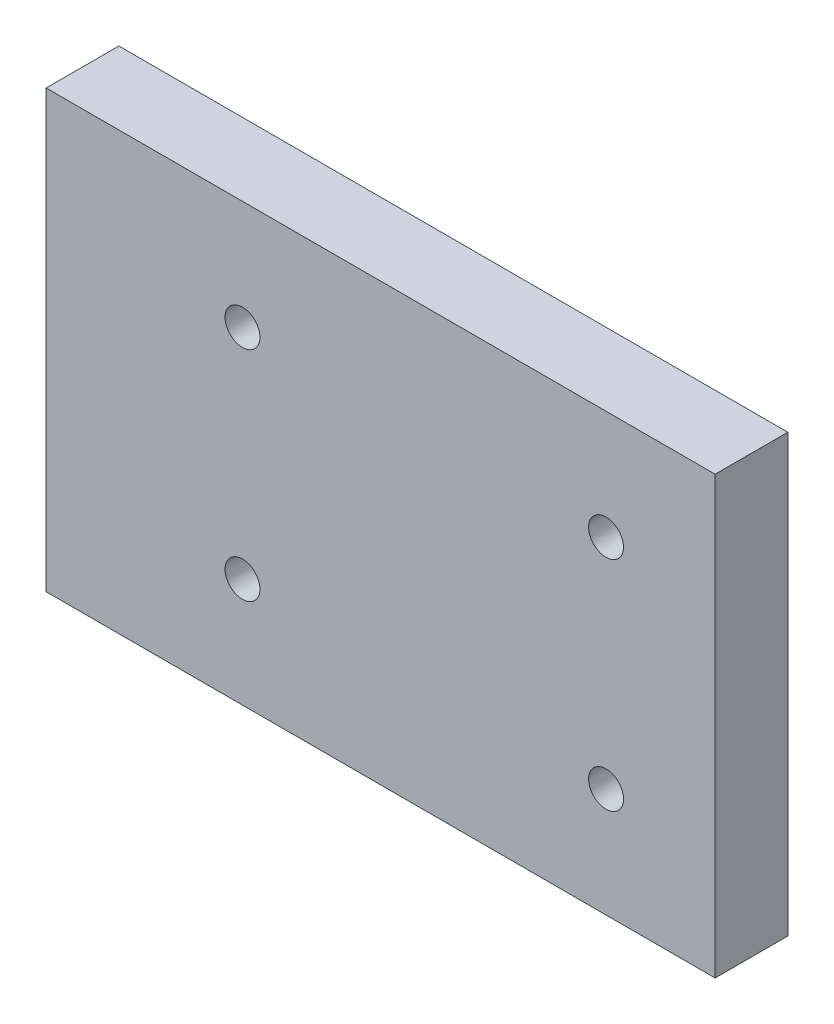
ISO-10303-21;
HEADER;
FILE_DESCRIPTION(('STEP AP214'),'2;1');
FILE_NAME('part.step','',(''),(''),'','','');
FILE_SCHEMA(('AUTOMOTIVE_DESIGN { 1 0 10303 214 1 1 1 1 }'));
ENDSEC;
DATA;
#1=APPLICATION_CONTEXT('core data for automotive mechanical design processes');
#2=APPLICATION_PROTOCOL_DEFINITION('international standard','automotive_design',2000,#1);
#3=PRODUCT_CONTEXT('',#1,'mechanical');
#4=PRODUCT('Part','Part','',(#3));
#5=PRODUCT_RELATED_PRODUCT_CATEGORY('part','',(#4));
#6=PRODUCT_DEFINITION_FORMATION('','',#4);
#7=PRODUCT_DEFINITION_CONTEXT('part definition',#1,'design');
#8=PRODUCT_DEFINITION('design','',#6,#7);
#9=PRODUCT_DEFINITION_SHAPE('','',#8);
#10=(LENGTH_UNIT() NAMED_UNIT(*) SI_UNIT(.MILLI.,.METRE.));
#11=(NAMED_UNIT(*) PLANE_ANGLE_UNIT() SI_UNIT($,.RADIAN.));
#12=(NAMED_UNIT(*) SI_UNIT($,.STERADIAN.) SOLID_ANGLE_UNIT());
#13=UNCERTAINTY_MEASURE_WITH_UNIT(LENGTH_MEASURE(1.E-05),#10,'distance_accuracy_value','');
#14=(GEOMETRIC_REPRESENTATION_CONTEXT(3) GLOBAL_UNCERTAINTY_ASSIGNED_CONTEXT((#13)) GLOBAL_UNIT_ASSIGNED_CONTEXT((#10,
#11,#12)) REPRESENTATION_CONTEXT('',''));
#15=CARTESIAN_POINT('',(0.,0.,0.));
#16=DIRECTION('',(0.,0.,1.));
#17=DIRECTION('',(1.,0.,0.));
#18=AXIS2_PLACEMENT_3D('',#15,#16,#17);
#19=CARTESIAN_POINT('',(0.,0.,6.35));
#20=DIRECTION('',(0.,0.,1.));
#21=DIRECTION('',(1.,0.,0.));
#22=AXIS2_PLACEMENT_3D('',#19,#20,#21);
#23=PLANE('',#22);
#24=CARTESIAN_POINT('',(-9.52500000000019,47.441126629083,6.35));
#25=DIRECTION('',(0.,0.,1.));
#26=DIRECTION('',(1.,0.,0.));
#27=AXIS2_PLACEMENT_3D('',#24,#25,#26);
#28=CIRCLE('',#27,1.524);
#29=CARTESIAN_POINT('',(-8.00100000000019,47.441126629083,6.35));
#30=VERTEX_POINT('',#29);
#31=EDGE_CURVE('E123',#30,#30,#28,.T.);
#32=ORIENTED_EDGE('',*,*,#31,.F.);
#33=EDGE_LOOP('',(#32));
#34=FACE_BOUND('',#33,.T.);
#35=CARTESIAN_POINT('',(22.2249999999998,47.4411266290832,6.35));
#36=DIRECTION('',(0.,0.,1.));
#37=DIRECTION('',(1.,0.,0.));
#38=AXIS2_PLACEMENT_3D('',#35,#36,#37);
#39=CIRCLE('',#38,1.524);
#40=CARTESIAN_POINT('',(23.7489999999998,47.4411266290832,6.35));
#41=VERTEX_POINT('',#40);
#42=EDGE_CURVE('E102',#41,#41,#39,.T.);
#43=ORIENTED_EDGE('',*,*,#42,.F.);
#44=EDGE_LOOP('',(#43));
#45=FACE_BOUND('',#44,.T.);
#46=DIRECTION('',(0.,-1.,0.));
#47=VECTOR('',#46,1.);
#48=CARTESIAN_POINT('',(-26.6700000000001,18.8661266290832,6.35));
#49=LINE('',#48,#47);
#50=CARTESIAN_POINT('',(-26.6700000000001,56.9661266290832,6.35));
#51=VERTEX_POINT('',#50);
#52=CARTESIAN_POINT('',(-26.6700000000001,18.8661266290832,6.35));
#53=VERTEX_POINT('',#52);
#54=EDGE_CURVE('E87',#51,#53,#49,.T.);
#55=ORIENTED_EDGE('',*,*,#54,.T.);
#56=DIRECTION('',(1.,0.,0.));
#57=VECTOR('',#56,1.);
#58=CARTESIAN_POINT('',(31.7499999999999,18.8661266290833,6.35));
#59=LINE('',#58,#57);
#60=CARTESIAN_POINT('',(31.7499999999999,18.8661266290833,6.35));
#61=VERTEX_POINT('',#60);
#62=EDGE_CURVE('E82',#53,#61,#59,.T.);
#63=ORIENTED_EDGE('',*,*,#62,.T.);
#64=DIRECTION('',(0.,1.,0.));
#65=VECTOR('',#64,1.);
#66=CARTESIAN_POINT('',(31.7499999999999,18.8661266290833,6.35));
#67=LINE('',#66,#65);
#68=CARTESIAN_POINT('',(31.7499999999998,56.9661266290832,6.35));
#69=VERTEX_POINT('',#68);
#70=EDGE_CURVE('E85',#61,#69,#67,.T.);
#71=ORIENTED_EDGE('',*,*,#70,.T.);
#72=DIRECTION('',(-1.,0.,0.));
#73=VECTOR('',#72,1.);
#74=CARTESIAN_POINT('',(31.7499999999998,56.9661266290832,6.35));
#75=LINE('',#74,#73);
#76=EDGE_CURVE('E52',#69,#51,#75,.T.);
#77=ORIENTED_EDGE('',*,*,#76,.T.);
#78=EDGE_LOOP('',(#55,#63,#71,#77));
#79=FACE_BOUND('',#78,.T.);
#80=CARTESIAN_POINT('',(22.2249999999998,28.3911266290832,6.35));
#81=DIRECTION('',(0.,0.,1.));
#82=DIRECTION('',(-1.,0.,0.));
#83=AXIS2_PLACEMENT_3D('',#80,#81,#82);
#84=CIRCLE('',#83,1.524);
#85=CARTESIAN_POINT('',(20.7009999999998,28.3911266290832,6.35));
#86=VERTEX_POINT('',#85);
#87=EDGE_CURVE('E117',#86,#86,#84,.T.);
#88=ORIENTED_EDGE('',*,*,#87,.F.);
#89=EDGE_LOOP('',(#88));
#90=FACE_BOUND('',#89,.T.);
#91=CARTESIAN_POINT('',(-9.52500000000019,28.391126629083,6.35));
#92=DIRECTION('',(0.,0.,1.));
#93=DIRECTION('',(-1.,0.,0.));
#94=AXIS2_PLACEMENT_3D('',#91,#92,#93);
#95=CIRCLE('',#94,1.524);
#96=CARTESIAN_POINT('',(-11.0490000000002,28.391126629083,6.35));
#97=VERTEX_POINT('',#96);
#98=EDGE_CURVE('E129',#97,#97,#95,.T.);
#99=ORIENTED_EDGE('',*,*,#98,.F.);
#100=EDGE_LOOP('',(#99));
#101=FACE_BOUND('',#100,.T.);
#102=ADVANCED_FACE('F35',(#34,#45,#79,#90,#101),#23,.T.);
#103=CARTESIAN_POINT('',(0.,0.,0.));
#104=DIRECTION('',(0.,0.,1.));
#105=DIRECTION('',(1.,0.,0.));
#106=AXIS2_PLACEMENT_3D('',#103,#104,#105);
#107=PLANE('',#106);
#108=DIRECTION('',(0.,-1.,0.));
#109=VECTOR('',#108,1.);
#110=CARTESIAN_POINT('',(-26.6700000000001,18.8661266290832,0.));
#111=LINE('',#110,#109);
#112=CARTESIAN_POINT('',(-26.6700000000001,56.9661266290832,0.));
#113=VERTEX_POINT('',#112);
#114=CARTESIAN_POINT('',(-26.6700000000001,18.8661266290832,0.));
#115=VERTEX_POINT('',#114);
#116=EDGE_CURVE('E99',#113,#115,#111,.T.);
#117=ORIENTED_EDGE('',*,*,#116,.F.);
#118=DIRECTION('',(-1.,0.,0.));
#119=VECTOR('',#118,1.);
#120=CARTESIAN_POINT('',(31.7499999999998,56.9661266290832,0.));
#121=LINE('',#120,#119);
#122=CARTESIAN_POINT('',(31.7499999999998,56.9661266290832,0.));
#123=VERTEX_POINT('',#122);
#124=EDGE_CURVE('E75',#123,#113,#121,.T.);
#125=ORIENTED_EDGE('',*,*,#124,.F.);
#126=DIRECTION('',(0.,1.,0.));
#127=VECTOR('',#126,1.);
#128=CARTESIAN_POINT('',(31.7499999999999,18.8661266290833,0.));
#129=LINE('',#128,#127);
#130=CARTESIAN_POINT('',(31.7499999999999,18.8661266290833,0.));
#131=VERTEX_POINT('',#130);
#132=EDGE_CURVE('E69',#131,#123,#129,.T.);
#133=ORIENTED_EDGE('',*,*,#132,.F.);
#134=DIRECTION('',(1.,0.,0.));
#135=VECTOR('',#134,1.);
#136=CARTESIAN_POINT('',(31.7499999999999,18.8661266290833,0.));
#137=LINE('',#136,#135);
#138=EDGE_CURVE('E91',#115,#131,#137,.T.);
#139=ORIENTED_EDGE('',*,*,#138,.F.);
#140=EDGE_LOOP('',(#117,#125,#133,#139));
#141=FACE_BOUND('',#140,.T.);
#142=CARTESIAN_POINT('',(22.2249999999998,47.4411266290832,0.));
#143=DIRECTION('',(0.,0.,1.));
#144=DIRECTION('',(1.,0.,0.));
#145=AXIS2_PLACEMENT_3D('',#142,#143,#144);
#146=CIRCLE('',#145,1.524);
#147=CARTESIAN_POINT('',(23.7489999999998,47.4411266290832,0.));
#148=VERTEX_POINT('',#147);
#149=EDGE_CURVE('E114',#148,#148,#146,.T.);
#150=ORIENTED_EDGE('',*,*,#149,.T.);
#151=EDGE_LOOP('',(#150));
#152=FACE_BOUND('',#151,.T.);
#153=CARTESIAN_POINT('',(22.2249999999998,28.3911266290832,0.));
#154=DIRECTION('',(0.,0.,1.));
#155=DIRECTION('',(-1.,0.,0.));
#156=AXIS2_PLACEMENT_3D('',#153,#154,#155);
#157=CIRCLE('',#156,1.524);
#158=CARTESIAN_POINT('',(20.7009999999998,28.3911266290832,0.));
#159=VERTEX_POINT('',#158);
#160=EDGE_CURVE('E120',#159,#159,#157,.T.);
#161=ORIENTED_EDGE('',*,*,#160,.T.);
#162=EDGE_LOOP('',(#161));
#163=FACE_BOUND('',#162,.T.);
#164=CARTESIAN_POINT('',(-9.52500000000019,47.441126629083,0.));
#165=DIRECTION('',(0.,0.,1.));
#166=DIRECTION('',(1.,0.,0.));
#167=AXIS2_PLACEMENT_3D('',#164,#165,#166);
#168=CIRCLE('',#167,1.524);
#169=CARTESIAN_POINT('',(-8.00100000000019,47.441126629083,0.));
#170=VERTEX_POINT('',#169);
#171=EDGE_CURVE('E126',#170,#170,#168,.T.);
#172=ORIENTED_EDGE('',*,*,#171,.T.);
#173=EDGE_LOOP('',(#172));
#174=FACE_BOUND('',#173,.T.);
#175=CARTESIAN_POINT('',(-9.52500000000019,28.391126629083,0.));
#176=DIRECTION('',(0.,0.,1.));
#177=DIRECTION('',(-1.,0.,0.));
#178=AXIS2_PLACEMENT_3D('',#175,#176,#177);
#179=CIRCLE('',#178,1.524);
#180=CARTESIAN_POINT('',(-11.0490000000002,28.391126629083,0.));
#181=VERTEX_POINT('',#180);
#182=EDGE_CURVE('E132',#181,#181,#179,.T.);
#183=ORIENTED_EDGE('',*,*,#182,.T.);
#184=EDGE_LOOP('',(#183));
#185=FACE_BOUND('',#184,.T.);
#186=ADVANCED_FACE('F110',(#141,#152,#163,#174,#185),#107,.F.);
#187=CARTESIAN_POINT('',(-26.6700000000001,18.8661266290832,6.35));
#188=DIRECTION('',(1.,0.,0.));
#189=DIRECTION('',(0.,1.,0.));
#190=AXIS2_PLACEMENT_3D('',#187,#188,#189);
#191=PLANE('',#190);
#192=ORIENTED_EDGE('',*,*,#116,.T.);
#193=DIRECTION('',(0.,0.,-1.));
#194=VECTOR('',#193,1.);
#195=CARTESIAN_POINT('',(-26.6700000000001,18.8661266290832,6.35));
#196=LINE('',#195,#194);
#197=EDGE_CURVE('E11',#53,#115,#196,.T.);
#198=ORIENTED_EDGE('',*,*,#197,.F.);
#199=ORIENTED_EDGE('',*,*,#54,.F.);
#200=DIRECTION('',(0.,0.,-1.));
#201=VECTOR('',#200,1.);
#202=CARTESIAN_POINT('',(-26.6700000000001,56.9661266290832,6.35));
#203=LINE('',#202,#201);
#204=EDGE_CURVE('E95',#51,#113,#203,.T.);
#205=ORIENTED_EDGE('',*,*,#204,.T.);
#206=EDGE_LOOP('',(#192,#198,#199,#205));
#207=FACE_BOUND('',#206,.T.);
#208=ADVANCED_FACE('F37',(#207),#191,.F.);
#209=CARTESIAN_POINT('',(31.7499999999999,18.8661266290833,6.35));
#210=DIRECTION('',(0.,1.,0.));
#211=DIRECTION('',(-1.,0.,0.));
#212=AXIS2_PLACEMENT_3D('',#209,#210,#211);
#213=PLANE('',#212);
#214=ORIENTED_EDGE('',*,*,#138,.T.);
#215=DIRECTION('',(0.,0.,-1.));
#216=VECTOR('',#215,1.);
#217=CARTESIAN_POINT('',(31.7499999999999,18.8661266290833,6.35));
#218=LINE('',#217,#216);
#219=EDGE_CURVE('E44',#61,#131,#218,.T.);
#220=ORIENTED_EDGE('',*,*,#219,.F.);
#221=ORIENTED_EDGE('',*,*,#62,.F.);
#222=ORIENTED_EDGE('',*,*,#197,.T.);
#223=EDGE_LOOP('',(#214,#220,#221,#222));
#224=FACE_BOUND('',#223,.T.);
#225=ADVANCED_FACE('F90',(#224),#213,.F.);
#226=CARTESIAN_POINT('',(31.7499999999999,18.8661266290833,6.35));
#227=DIRECTION('',(-1.,0.,0.));
#228=DIRECTION('',(0.,-1.,0.));
#229=AXIS2_PLACEMENT_3D('',#226,#227,#228);
#230=PLANE('',#229);
#231=ORIENTED_EDGE('',*,*,#132,.T.);
#232=DIRECTION('',(0.,0.,-1.));
#233=VECTOR('',#232,1.);
#234=CARTESIAN_POINT('',(31.7499999999998,56.9661266290832,6.35));
#235=LINE('',#234,#233);
#236=EDGE_CURVE('E92',#69,#123,#235,.T.);
#237=ORIENTED_EDGE('',*,*,#236,.F.);
#238=ORIENTED_EDGE('',*,*,#70,.F.);
#239=ORIENTED_EDGE('',*,*,#219,.T.);
#240=EDGE_LOOP('',(#231,#237,#238,#239));
#241=FACE_BOUND('',#240,.T.);
#242=ADVANCED_FACE('F93',(#241),#230,.F.);
#243=CARTESIAN_POINT('',(31.7499999999998,56.9661266290832,6.35));
#244=DIRECTION('',(0.,-1.,0.));
#245=DIRECTION('',(0.,0.,-1.));
#246=AXIS2_PLACEMENT_3D('',#243,#244,#245);
#247=PLANE('',#246);
#248=ORIENTED_EDGE('',*,*,#124,.T.);
#249=ORIENTED_EDGE('',*,*,#204,.F.);
#250=ORIENTED_EDGE('',*,*,#76,.F.);
#251=ORIENTED_EDGE('',*,*,#236,.T.);
#252=EDGE_LOOP('',(#248,#249,#250,#251));
#253=FACE_BOUND('',#252,.T.);
#254=ADVANCED_FACE('F107',(#253),#247,.F.);
#255=CARTESIAN_POINT('',(22.2249999999998,47.4411266290832,6.35));
#256=DIRECTION('',(0.,0.,-1.));
#257=DIRECTION('',(-1.,0.,0.));
#258=AXIS2_PLACEMENT_3D('',#255,#256,#257);
#259=CYLINDRICAL_SURFACE('',#258,1.524);
#260=ORIENTED_EDGE('',*,*,#42,.T.);
#261=EDGE_LOOP('',(#260));
#262=FACE_BOUND('',#261,.T.);
#263=ORIENTED_EDGE('',*,*,#149,.F.);
#264=EDGE_LOOP('',(#263));
#265=FACE_BOUND('',#264,.T.);
#266=ADVANCED_FACE('F151',(#262,#265),#259,.F.);
#267=CARTESIAN_POINT('',(22.2249999999998,28.3911266290832,6.35));
#268=DIRECTION('',(0.,0.,-1.));
#269=DIRECTION('',(-1.,0.,0.));
#270=AXIS2_PLACEMENT_3D('',#267,#268,#269);
#271=CYLINDRICAL_SURFACE('',#270,1.524);
#272=ORIENTED_EDGE('',*,*,#87,.T.);
#273=EDGE_LOOP('',(#272));
#274=FACE_BOUND('',#273,.T.);
#275=ORIENTED_EDGE('',*,*,#160,.F.);
#276=EDGE_LOOP('',(#275));
#277=FACE_BOUND('',#276,.T.);
#278=ADVANCED_FACE('F197',(#274,#277),#271,.F.);
#279=CARTESIAN_POINT('',(-9.52500000000019,47.441126629083,6.35));
#280=DIRECTION('',(0.,0.,-1.));
#281=DIRECTION('',(-1.,0.,0.));
#282=AXIS2_PLACEMENT_3D('',#279,#280,#281);
#283=CYLINDRICAL_SURFACE('',#282,1.524);
#284=ORIENTED_EDGE('',*,*,#31,.T.);
#285=EDGE_LOOP('',(#284));
#286=FACE_BOUND('',#285,.T.);
#287=ORIENTED_EDGE('',*,*,#171,.F.);
#288=EDGE_LOOP('',(#287));
#289=FACE_BOUND('',#288,.T.);
#290=ADVANCED_FACE('F205',(#286,#289),#283,.F.);
#291=CARTESIAN_POINT('',(-9.52500000000019,28.391126629083,6.35));
#292=DIRECTION('',(0.,0.,-1.));
#293=DIRECTION('',(-1.,0.,0.));
#294=AXIS2_PLACEMENT_3D('',#291,#292,#293);
#295=CYLINDRICAL_SURFACE('',#294,1.524);
#296=ORIENTED_EDGE('',*,*,#98,.T.);
#297=EDGE_LOOP('',(#296));
#298=FACE_BOUND('',#297,.T.);
#299=ORIENTED_EDGE('',*,*,#182,.F.);
#300=EDGE_LOOP('',(#299));
#301=FACE_BOUND('',#300,.T.);
#302=ADVANCED_FACE('F138',(#298,#301),#295,.F.);
#303=CLOSED_SHELL('',(#102,#186,#208,#225,#242,#254,#266,#278,#290,#302));
#304=MANIFOLD_SOLID_BREP('B2',#303);
#305=ADVANCED_BREP_SHAPE_REPRESENTATION('',(#18,#304),#14);
#306=SHAPE_DEFINITION_REPRESENTATION(#9,#305);
ENDSEC;
END-ISO-10303-21;
